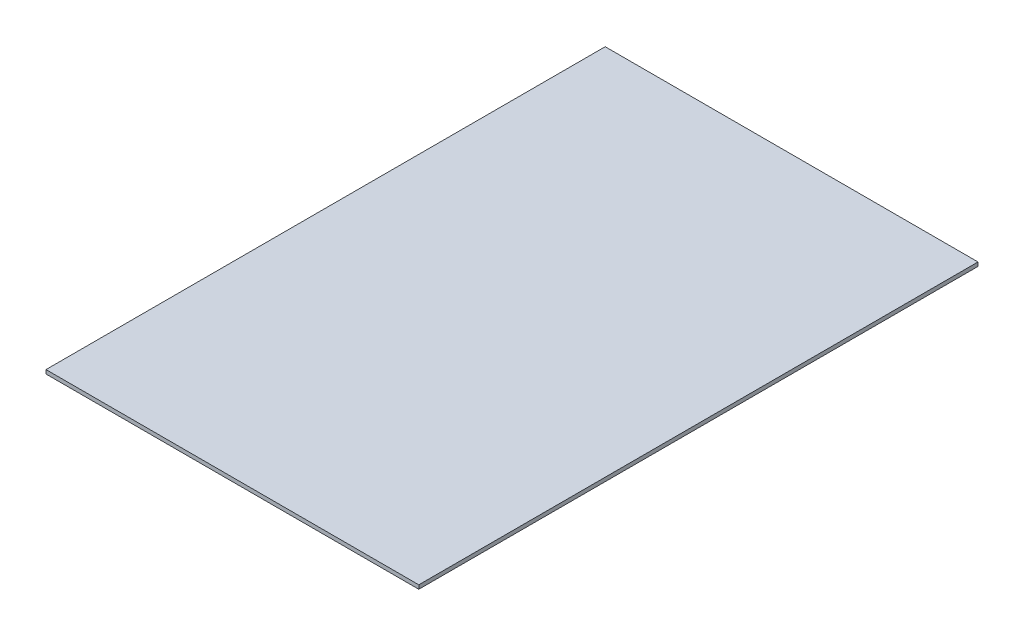
ISO-10303-21;
HEADER;
FILE_DESCRIPTION(('STEP AP214'),'2;1');
FILE_NAME('part.step','',(''),(''),'','','');
FILE_SCHEMA(('AUTOMOTIVE_DESIGN { 1 0 10303 214 1 1 1 1 }'));
ENDSEC;
DATA;
#1=APPLICATION_CONTEXT('core data for automotive mechanical design processes');
#2=APPLICATION_PROTOCOL_DEFINITION('international standard','automotive_design',2000,#1);
#3=PRODUCT_CONTEXT('',#1,'mechanical');
#4=PRODUCT('Part','Part','',(#3));
#5=PRODUCT_RELATED_PRODUCT_CATEGORY('part','',(#4));
#6=PRODUCT_DEFINITION_FORMATION('','',#4);
#7=PRODUCT_DEFINITION_CONTEXT('part definition',#1,'design');
#8=PRODUCT_DEFINITION('design','',#6,#7);
#9=PRODUCT_DEFINITION_SHAPE('','',#8);
#10=(LENGTH_UNIT() NAMED_UNIT(*) SI_UNIT(.MILLI.,.METRE.));
#11=(NAMED_UNIT(*) PLANE_ANGLE_UNIT() SI_UNIT($,.RADIAN.));
#12=(NAMED_UNIT(*) SI_UNIT($,.STERADIAN.) SOLID_ANGLE_UNIT());
#13=UNCERTAINTY_MEASURE_WITH_UNIT(LENGTH_MEASURE(1.E-05),#10,'distance_accuracy_value','');
#14=(GEOMETRIC_REPRESENTATION_CONTEXT(3) GLOBAL_UNCERTAINTY_ASSIGNED_CONTEXT((#13)) GLOBAL_UNIT_ASSIGNED_CONTEXT((#10,
#11,#12)) REPRESENTATION_CONTEXT('',''));
#15=CARTESIAN_POINT('',(0.,0.,0.));
#16=DIRECTION('',(0.,0.,1.));
#17=DIRECTION('',(1.,0.,0.));
#18=AXIS2_PLACEMENT_3D('',#15,#16,#17);
#19=CARTESIAN_POINT('',(-304.8,6.35,-457.2));
#20=DIRECTION('',(1.,0.,0.));
#21=DIRECTION('',(0.,0.,-1.));
#22=AXIS2_PLACEMENT_3D('',#19,#20,#21);
#23=PLANE('',#22);
#24=DIRECTION('',(0.,0.,1.));
#25=VECTOR('',#24,1.);
#26=CARTESIAN_POINT('',(-304.8,0.,-457.2));
#27=LINE('',#26,#25);
#28=CARTESIAN_POINT('',(-304.8,0.,-457.2));
#29=VERTEX_POINT('',#28);
#30=CARTESIAN_POINT('',(-304.8,0.,457.2));
#31=VERTEX_POINT('',#30);
#32=EDGE_CURVE('E95',#29,#31,#27,.T.);
#33=ORIENTED_EDGE('',*,*,#32,.T.);
#34=DIRECTION('',(0.,-1.,0.));
#35=VECTOR('',#34,1.);
#36=CARTESIAN_POINT('',(-304.8,6.35,457.2));
#37=LINE('',#36,#35);
#38=CARTESIAN_POINT('',(-304.8,6.35,457.2));
#39=VERTEX_POINT('',#38);
#40=EDGE_CURVE('E11',#39,#31,#37,.T.);
#41=ORIENTED_EDGE('',*,*,#40,.F.);
#42=DIRECTION('',(0.,0.,1.));
#43=VECTOR('',#42,1.);
#44=CARTESIAN_POINT('',(-304.8,6.35,-457.2));
#45=LINE('',#44,#43);
#46=CARTESIAN_POINT('',(-304.8,6.35,-457.2));
#47=VERTEX_POINT('',#46);
#48=EDGE_CURVE('E83',#47,#39,#45,.T.);
#49=ORIENTED_EDGE('',*,*,#48,.F.);
#50=DIRECTION('',(0.,-1.,0.));
#51=VECTOR('',#50,1.);
#52=CARTESIAN_POINT('',(-304.8,6.35,-457.2));
#53=LINE('',#52,#51);
#54=EDGE_CURVE('E91',#47,#29,#53,.T.);
#55=ORIENTED_EDGE('',*,*,#54,.T.);
#56=EDGE_LOOP('',(#33,#41,#49,#55));
#57=FACE_BOUND('',#56,.T.);
#58=ADVANCED_FACE('F32',(#57),#23,.F.);
#59=CARTESIAN_POINT('',(304.8,6.35,457.2));
#60=DIRECTION('',(0.,0.,-1.));
#61=DIRECTION('',(-1.,0.,0.));
#62=AXIS2_PLACEMENT_3D('',#59,#60,#61);
#63=PLANE('',#62);
#64=DIRECTION('',(1.,0.,0.));
#65=VECTOR('',#64,1.);
#66=CARTESIAN_POINT('',(304.8,0.,457.2));
#67=LINE('',#66,#65);
#68=CARTESIAN_POINT('',(304.8,0.,457.2));
#69=VERTEX_POINT('',#68);
#70=EDGE_CURVE('E87',#31,#69,#67,.T.);
#71=ORIENTED_EDGE('',*,*,#70,.T.);
#72=DIRECTION('',(0.,-1.,0.));
#73=VECTOR('',#72,1.);
#74=CARTESIAN_POINT('',(304.8,6.35,457.2));
#75=LINE('',#74,#73);
#76=CARTESIAN_POINT('',(304.8,6.35,457.2));
#77=VERTEX_POINT('',#76);
#78=EDGE_CURVE('E40',#77,#69,#75,.T.);
#79=ORIENTED_EDGE('',*,*,#78,.F.);
#80=DIRECTION('',(1.,0.,0.));
#81=VECTOR('',#80,1.);
#82=CARTESIAN_POINT('',(304.8,6.35,457.2));
#83=LINE('',#82,#81);
#84=EDGE_CURVE('E78',#39,#77,#83,.T.);
#85=ORIENTED_EDGE('',*,*,#84,.F.);
#86=ORIENTED_EDGE('',*,*,#40,.T.);
#87=EDGE_LOOP('',(#71,#79,#85,#86));
#88=FACE_BOUND('',#87,.T.);
#89=ADVANCED_FACE('F86',(#88),#63,.F.);
#90=CARTESIAN_POINT('',(304.8,6.35,-457.2));
#91=DIRECTION('',(-1.,0.,0.));
#92=DIRECTION('',(0.,0.,1.));
#93=AXIS2_PLACEMENT_3D('',#90,#91,#92);
#94=PLANE('',#93);
#95=DIRECTION('',(0.,0.,-1.));
#96=VECTOR('',#95,1.);
#97=CARTESIAN_POINT('',(304.8,0.,-457.2));
#98=LINE('',#97,#96);
#99=CARTESIAN_POINT('',(304.8,0.,-457.2));
#100=VERTEX_POINT('',#99);
#101=EDGE_CURVE('E65',#69,#100,#98,.T.);
#102=ORIENTED_EDGE('',*,*,#101,.T.);
#103=DIRECTION('',(0.,-1.,0.));
#104=VECTOR('',#103,1.);
#105=CARTESIAN_POINT('',(304.8,6.35,-457.2));
#106=LINE('',#105,#104);
#107=CARTESIAN_POINT('',(304.8,6.35,-457.2));
#108=VERTEX_POINT('',#107);
#109=EDGE_CURVE('E88',#108,#100,#106,.T.);
#110=ORIENTED_EDGE('',*,*,#109,.F.);
#111=DIRECTION('',(0.,0.,-1.));
#112=VECTOR('',#111,1.);
#113=CARTESIAN_POINT('',(304.8,6.35,-457.2));
#114=LINE('',#113,#112);
#115=EDGE_CURVE('E81',#77,#108,#114,.T.);
#116=ORIENTED_EDGE('',*,*,#115,.F.);
#117=ORIENTED_EDGE('',*,*,#78,.T.);
#118=EDGE_LOOP('',(#102,#110,#116,#117));
#119=FACE_BOUND('',#118,.T.);
#120=ADVANCED_FACE('F89',(#119),#94,.F.);
#121=CARTESIAN_POINT('',(304.8,6.35,-457.2));
#122=DIRECTION('',(0.,0.,1.));
#123=DIRECTION('',(1.,0.,0.));
#124=AXIS2_PLACEMENT_3D('',#121,#122,#123);
#125=PLANE('',#124);
#126=DIRECTION('',(-1.,0.,0.));
#127=VECTOR('',#126,1.);
#128=CARTESIAN_POINT('',(304.8,0.,-457.2));
#129=LINE('',#128,#127);
#130=EDGE_CURVE('E71',#100,#29,#129,.T.);
#131=ORIENTED_EDGE('',*,*,#130,.T.);
#132=ORIENTED_EDGE('',*,*,#54,.F.);
#133=DIRECTION('',(-1.,0.,0.));
#134=VECTOR('',#133,1.);
#135=CARTESIAN_POINT('',(304.8,6.35,-457.2));
#136=LINE('',#135,#134);
#137=EDGE_CURVE('E48',#108,#47,#136,.T.);
#138=ORIENTED_EDGE('',*,*,#137,.F.);
#139=ORIENTED_EDGE('',*,*,#109,.T.);
#140=EDGE_LOOP('',(#131,#132,#138,#139));
#141=FACE_BOUND('',#140,.T.);
#142=ADVANCED_FACE('F102',(#141),#125,.F.);
#143=CARTESIAN_POINT('',(0.,6.35,0.));
#144=DIRECTION('',(0.,-1.,0.));
#145=DIRECTION('',(0.,0.,-1.));
#146=AXIS2_PLACEMENT_3D('',#143,#144,#145);
#147=PLANE('',#146);
#148=ORIENTED_EDGE('',*,*,#48,.T.);
#149=ORIENTED_EDGE('',*,*,#84,.T.);
#150=ORIENTED_EDGE('',*,*,#115,.T.);
#151=ORIENTED_EDGE('',*,*,#137,.T.);
#152=EDGE_LOOP('',(#148,#149,#150,#151));
#153=FACE_BOUND('',#152,.T.);
#154=ADVANCED_FACE('F79',(#153),#147,.F.);
#155=CARTESIAN_POINT('',(0.,0.,0.));
#156=DIRECTION('',(0.,-1.,0.));
#157=DIRECTION('',(0.,0.,-1.));
#158=AXIS2_PLACEMENT_3D('',#155,#156,#157);
#159=PLANE('',#158);
#160=ORIENTED_EDGE('',*,*,#32,.F.);
#161=ORIENTED_EDGE('',*,*,#130,.F.);
#162=ORIENTED_EDGE('',*,*,#101,.F.);
#163=ORIENTED_EDGE('',*,*,#70,.F.);
#164=EDGE_LOOP('',(#160,#161,#162,#163));
#165=FACE_BOUND('',#164,.T.);
#166=ADVANCED_FACE('F105',(#165),#159,.T.);
#167=CLOSED_SHELL('',(#58,#89,#120,#142,#154,#166));
#168=MANIFOLD_SOLID_BREP('B2',#167);
#169=ADVANCED_BREP_SHAPE_REPRESENTATION('',(#18,#168),#14);
#170=SHAPE_DEFINITION_REPRESENTATION(#9,#169);
ENDSEC;
END-ISO-10303-21;
